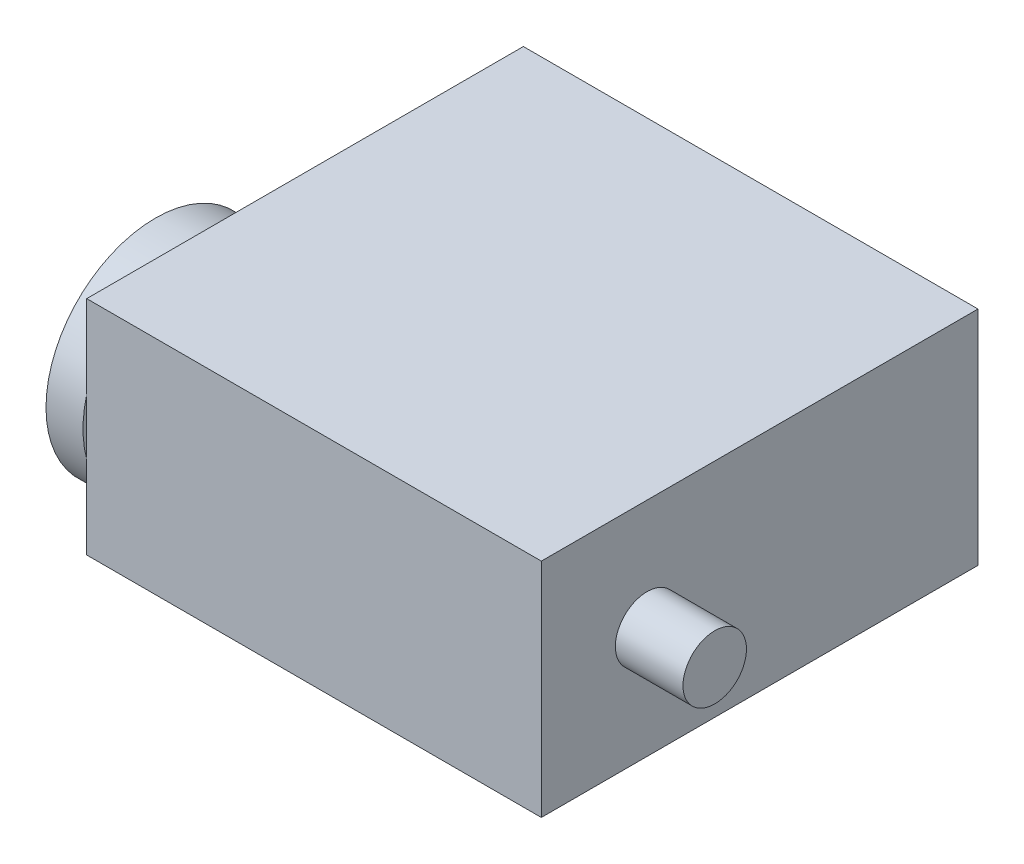
ISO-10303-21;
HEADER;
FILE_DESCRIPTION(('STEP AP214'),'2;1');
FILE_NAME('part.step','',(''),(''),'','','');
FILE_SCHEMA(('AUTOMOTIVE_DESIGN { 1 0 10303 214 1 1 1 1 }'));
ENDSEC;
DATA;
#1=APPLICATION_CONTEXT('core data for automotive mechanical design processes');
#2=APPLICATION_PROTOCOL_DEFINITION('international standard','automotive_design',2000,#1);
#3=PRODUCT_CONTEXT('',#1,'mechanical');
#4=PRODUCT('Part','Part','',(#3));
#5=PRODUCT_RELATED_PRODUCT_CATEGORY('part','',(#4));
#6=PRODUCT_DEFINITION_FORMATION('','',#4);
#7=PRODUCT_DEFINITION_CONTEXT('part definition',#1,'design');
#8=PRODUCT_DEFINITION('design','',#6,#7);
#9=PRODUCT_DEFINITION_SHAPE('','',#8);
#10=(LENGTH_UNIT() NAMED_UNIT(*) SI_UNIT(.MILLI.,.METRE.));
#11=(NAMED_UNIT(*) PLANE_ANGLE_UNIT() SI_UNIT($,.RADIAN.));
#12=(NAMED_UNIT(*) SI_UNIT($,.STERADIAN.) SOLID_ANGLE_UNIT());
#13=UNCERTAINTY_MEASURE_WITH_UNIT(LENGTH_MEASURE(1.E-05),#10,'distance_accuracy_value','');
#14=(GEOMETRIC_REPRESENTATION_CONTEXT(3) GLOBAL_UNCERTAINTY_ASSIGNED_CONTEXT((#13)) GLOBAL_UNIT_ASSIGNED_CONTEXT((#10,
#11,#12)) REPRESENTATION_CONTEXT('',''));
#15=CARTESIAN_POINT('',(0.,0.,0.));
#16=DIRECTION('',(0.,0.,1.));
#17=DIRECTION('',(1.,0.,0.));
#18=AXIS2_PLACEMENT_3D('',#15,#16,#17);
#19=CARTESIAN_POINT('',(-25.,10.5,41.3));
#20=DIRECTION('',(-1.,0.,0.));
#21=DIRECTION('',(0.,-1.,0.));
#22=AXIS2_PLACEMENT_3D('',#19,#20,#21);
#23=PLANE('',#22);
#24=CARTESIAN_POINT('',(-25.,7.45,31.3000000000001));
#25=DIRECTION('',(-1.,0.,0.));
#26=DIRECTION('',(0.,-1.,0.));
#27=AXIS2_PLACEMENT_3D('',#24,#25,#26);
#28=CIRCLE('',#27,0.749999999999996);
#29=CARTESIAN_POINT('',(-25.,6.70000000000001,31.3000000000001));
#30=VERTEX_POINT('',#29);
#31=EDGE_CURVE('E346',#30,#30,#28,.T.);
#32=ORIENTED_EDGE('',*,*,#31,.F.);
#33=EDGE_LOOP('',(#32));
#34=FACE_BOUND('',#33,.T.);
#35=CARTESIAN_POINT('',(-25.,0.,23.85));
#36=DIRECTION('',(-1.,0.,0.));
#37=DIRECTION('',(0.,-1.,0.));
#38=AXIS2_PLACEMENT_3D('',#35,#36,#37);
#39=CIRCLE('',#38,0.749999999999997);
#40=CARTESIAN_POINT('',(-25.,-0.749999999999936,23.85));
#41=VERTEX_POINT('',#40);
#42=EDGE_CURVE('E345',#41,#41,#39,.T.);
#43=ORIENTED_EDGE('',*,*,#42,.F.);
#44=EDGE_LOOP('',(#43));
#45=FACE_BOUND('',#44,.T.);
#46=CARTESIAN_POINT('',(-25.,-7.44999999999999,31.3));
#47=DIRECTION('',(-1.,0.,0.));
#48=DIRECTION('',(0.,-1.,0.));
#49=AXIS2_PLACEMENT_3D('',#46,#47,#48);
#50=CIRCLE('',#49,0.749999999999997);
#51=CARTESIAN_POINT('',(-25.,-8.19999999999999,31.3));
#52=VERTEX_POINT('',#51);
#53=EDGE_CURVE('E355',#52,#52,#50,.T.);
#54=ORIENTED_EDGE('',*,*,#53,.F.);
#55=EDGE_LOOP('',(#54));
#56=FACE_BOUND('',#55,.T.);
#57=CARTESIAN_POINT('',(-25.,0.,38.75));
#58=DIRECTION('',(-1.,0.,0.));
#59=DIRECTION('',(0.,-1.,0.));
#60=AXIS2_PLACEMENT_3D('',#57,#58,#59);
#61=CIRCLE('',#60,0.749999999999999);
#62=CARTESIAN_POINT('',(-25.,-0.749999999999993,38.75));
#63=VERTEX_POINT('',#62);
#64=EDGE_CURVE('E360',#63,#63,#61,.T.);
#65=ORIENTED_EDGE('',*,*,#64,.F.);
#66=EDGE_LOOP('',(#65));
#67=FACE_BOUND('',#66,.T.);
#68=CARTESIAN_POINT('',(-25.,0.,31.3));
#69=DIRECTION('',(-1.,0.,0.));
#70=DIRECTION('',(0.,-1.,0.));
#71=AXIS2_PLACEMENT_3D('',#68,#69,#70);
#72=CIRCLE('',#71,10.35);
#73=CARTESIAN_POINT('',(-25.,-10.35,31.3));
#74=VERTEX_POINT('',#73);
#75=EDGE_CURVE('E108',#74,#74,#72,.T.);
#76=ORIENTED_EDGE('',*,*,#75,.T.);
#77=EDGE_LOOP('',(#76));
#78=FACE_BOUND('',#77,.T.);
#79=CARTESIAN_POINT('',(-25.,0.,31.3));
#80=DIRECTION('',(-1.,0.,0.));
#81=DIRECTION('',(0.,-1.,0.));
#82=AXIS2_PLACEMENT_3D('',#79,#80,#81);
#83=CIRCLE('',#82,6.);
#84=CARTESIAN_POINT('',(-25.,-6.,31.3));
#85=VERTEX_POINT('',#84);
#86=EDGE_CURVE('E113',#85,#85,#83,.T.);
#87=ORIENTED_EDGE('',*,*,#86,.F.);
#88=EDGE_LOOP('',(#87));
#89=FACE_BOUND('',#88,.T.);
#90=ADVANCED_FACE('F37',(#34,#45,#56,#67,#78,#89),#23,.T.);
#91=CARTESIAN_POINT('',(-21.5,10.5,41.3));
#92=DIRECTION('',(1.,0.,0.));
#93=DIRECTION('',(0.,0.,-1.));
#94=AXIS2_PLACEMENT_3D('',#91,#92,#93);
#95=PLANE('',#94);
#96=CARTESIAN_POINT('',(-21.5,0.,31.3));
#97=DIRECTION('',(-1.,0.,0.));
#98=DIRECTION('',(0.,0.,1.));
#99=AXIS2_PLACEMENT_3D('',#96,#97,#98);
#100=CIRCLE('',#99,10.35);
#101=CARTESIAN_POINT('',(-21.5,2.66880122901651,41.3));
#102=VERTEX_POINT('',#101);
#103=CARTESIAN_POINT('',(-21.5,-2.66880122901649,41.3));
#104=VERTEX_POINT('',#103);
#105=EDGE_CURVE('E52',#102,#104,#100,.T.);
#106=ORIENTED_EDGE('',*,*,#105,.F.);
#107=DIRECTION('',(0.,-1.,0.));
#108=VECTOR('',#107,1.);
#109=CARTESIAN_POINT('',(-21.5,10.5,41.3));
#110=LINE('',#109,#108);
#111=CARTESIAN_POINT('',(-21.5,10.5,41.3));
#112=VERTEX_POINT('',#111);
#113=EDGE_CURVE('E93',#112,#102,#110,.T.);
#114=ORIENTED_EDGE('',*,*,#113,.F.);
#115=DIRECTION('',(0.,0.,-1.));
#116=VECTOR('',#115,1.);
#117=CARTESIAN_POINT('',(-21.5,10.5,41.3));
#118=LINE('',#117,#116);
#119=CARTESIAN_POINT('',(-21.5,10.5,0.));
#120=VERTEX_POINT('',#119);
#121=EDGE_CURVE('E124',#112,#120,#118,.T.);
#122=ORIENTED_EDGE('',*,*,#121,.T.);
#123=DIRECTION('',(0.,-1.,0.));
#124=VECTOR('',#123,1.);
#125=CARTESIAN_POINT('',(-21.5,10.5,0.));
#126=LINE('',#125,#124);
#127=CARTESIAN_POINT('',(-21.5,-10.5,0.));
#128=VERTEX_POINT('',#127);
#129=EDGE_CURVE('E117',#120,#128,#126,.T.);
#130=ORIENTED_EDGE('',*,*,#129,.T.);
#131=DIRECTION('',(0.,0.,-1.));
#132=VECTOR('',#131,1.);
#133=CARTESIAN_POINT('',(-21.5,-10.5,41.3));
#134=LINE('',#133,#132);
#135=CARTESIAN_POINT('',(-21.5,-10.5,41.3));
#136=VERTEX_POINT('',#135);
#137=EDGE_CURVE('E45',#136,#128,#134,.T.);
#138=ORIENTED_EDGE('',*,*,#137,.F.);
#139=EDGE_CURVE('E87',#104,#136,#110,.T.);
#140=ORIENTED_EDGE('',*,*,#139,.F.);
#141=EDGE_LOOP('',(#106,#114,#122,#130,#138,#140));
#142=FACE_BOUND('',#141,.T.);
#143=ADVANCED_FACE('F39',(#142),#95,.F.);
#144=CARTESIAN_POINT('',(21.5,10.5,41.3));
#145=DIRECTION('',(-1.,0.,0.));
#146=DIRECTION('',(0.,-1.,0.));
#147=AXIS2_PLACEMENT_3D('',#144,#145,#146);
#148=PLANE('',#147);
#149=DIRECTION('',(0.,1.,0.));
#150=VECTOR('',#149,1.);
#151=CARTESIAN_POINT('',(21.5,10.5,0.));
#152=LINE('',#151,#150);
#153=CARTESIAN_POINT('',(21.5,-10.5,0.));
#154=VERTEX_POINT('',#153);
#155=CARTESIAN_POINT('',(21.5,10.5,0.));
#156=VERTEX_POINT('',#155);
#157=EDGE_CURVE('E128',#154,#156,#152,.T.);
#158=ORIENTED_EDGE('',*,*,#157,.T.);
#159=DIRECTION('',(0.,0.,-1.));
#160=VECTOR('',#159,1.);
#161=CARTESIAN_POINT('',(21.5,10.5,41.3));
#162=LINE('',#161,#160);
#163=CARTESIAN_POINT('',(21.5,10.5,41.3));
#164=VERTEX_POINT('',#163);
#165=EDGE_CURVE('E132',#164,#156,#162,.T.);
#166=ORIENTED_EDGE('',*,*,#165,.F.);
#167=DIRECTION('',(0.,1.,0.));
#168=VECTOR('',#167,1.);
#169=CARTESIAN_POINT('',(21.5,10.5,41.3));
#170=LINE('',#169,#168);
#171=CARTESIAN_POINT('',(21.5,-10.5,41.3));
#172=VERTEX_POINT('',#171);
#173=EDGE_CURVE('E121',#172,#164,#170,.T.);
#174=ORIENTED_EDGE('',*,*,#173,.F.);
#175=DIRECTION('',(0.,0.,-1.));
#176=VECTOR('',#175,1.);
#177=CARTESIAN_POINT('',(21.5,-10.5,41.3));
#178=LINE('',#177,#176);
#179=EDGE_CURVE('E134',#172,#154,#178,.T.);
#180=ORIENTED_EDGE('',*,*,#179,.T.);
#181=EDGE_LOOP('',(#158,#166,#174,#180));
#182=FACE_BOUND('',#181,.T.);
#183=CARTESIAN_POINT('',(21.5,0.,31.3));
#184=DIRECTION('',(-1.,0.,0.));
#185=DIRECTION('',(0.,-1.,0.));
#186=AXIS2_PLACEMENT_3D('',#183,#184,#185);
#187=CIRCLE('',#186,3.);
#188=CARTESIAN_POINT('',(21.5,-2.99999999999999,31.3));
#189=VERTEX_POINT('',#188);
#190=EDGE_CURVE('E12',#189,#189,#187,.F.);
#191=ORIENTED_EDGE('',*,*,#190,.F.);
#192=EDGE_LOOP('',(#191));
#193=FACE_BOUND('',#192,.T.);
#194=ADVANCED_FACE('F145',(#182,#193),#148,.F.);
#195=CARTESIAN_POINT('',(21.5,-10.5,41.3));
#196=DIRECTION('',(0.,1.,0.));
#197=DIRECTION('',(-1.,0.,0.));
#198=AXIS2_PLACEMENT_3D('',#195,#196,#197);
#199=PLANE('',#198);
#200=DIRECTION('',(1.,0.,0.));
#201=VECTOR('',#200,1.);
#202=CARTESIAN_POINT('',(21.5,-10.5,0.));
#203=LINE('',#202,#201);
#204=EDGE_CURVE('E126',#128,#154,#203,.T.);
#205=ORIENTED_EDGE('',*,*,#204,.T.);
#206=ORIENTED_EDGE('',*,*,#179,.F.);
#207=DIRECTION('',(1.,0.,0.));
#208=VECTOR('',#207,1.);
#209=CARTESIAN_POINT('',(21.5,-10.5,41.3));
#210=LINE('',#209,#208);
#211=EDGE_CURVE('E119',#136,#172,#210,.T.);
#212=ORIENTED_EDGE('',*,*,#211,.F.);
#213=ORIENTED_EDGE('',*,*,#137,.T.);
#214=EDGE_LOOP('',(#205,#206,#212,#213));
#215=FACE_BOUND('',#214,.T.);
#216=ADVANCED_FACE('F137',(#215),#199,.F.);
#217=CARTESIAN_POINT('',(21.5,10.5,41.3));
#218=DIRECTION('',(0.,-1.,0.));
#219=DIRECTION('',(1.,0.,0.));
#220=AXIS2_PLACEMENT_3D('',#217,#218,#219);
#221=PLANE('',#220);
#222=DIRECTION('',(-1.,0.,0.));
#223=VECTOR('',#222,1.);
#224=CARTESIAN_POINT('',(21.5,10.5,0.));
#225=LINE('',#224,#223);
#226=EDGE_CURVE('E81',#156,#120,#225,.T.);
#227=ORIENTED_EDGE('',*,*,#226,.T.);
#228=ORIENTED_EDGE('',*,*,#121,.F.);
#229=DIRECTION('',(-1.,0.,0.));
#230=VECTOR('',#229,1.);
#231=CARTESIAN_POINT('',(21.5,10.5,41.3));
#232=LINE('',#231,#230);
#233=EDGE_CURVE('E60',#164,#112,#232,.T.);
#234=ORIENTED_EDGE('',*,*,#233,.F.);
#235=ORIENTED_EDGE('',*,*,#165,.T.);
#236=EDGE_LOOP('',(#227,#228,#234,#235));
#237=FACE_BOUND('',#236,.T.);
#238=ADVANCED_FACE('F148',(#237),#221,.F.);
#239=CARTESIAN_POINT('',(0.,0.,41.3));
#240=DIRECTION('',(0.,0.,-1.));
#241=DIRECTION('',(-1.,0.,0.));
#242=AXIS2_PLACEMENT_3D('',#239,#240,#241);
#243=PLANE('',#242);
#244=ORIENTED_EDGE('',*,*,#113,.T.);
#245=EDGE_CURVE('E91',#102,#104,#110,.T.);
#246=ORIENTED_EDGE('',*,*,#245,.T.);
#247=ORIENTED_EDGE('',*,*,#139,.T.);
#248=ORIENTED_EDGE('',*,*,#211,.T.);
#249=ORIENTED_EDGE('',*,*,#173,.T.);
#250=ORIENTED_EDGE('',*,*,#233,.T.);
#251=EDGE_LOOP('',(#244,#246,#247,#248,#249,#250));
#252=FACE_BOUND('',#251,.T.);
#253=ADVANCED_FACE('F92',(#252),#243,.F.);
#254=CARTESIAN_POINT('',(0.,0.,0.));
#255=DIRECTION('',(0.,0.,-1.));
#256=DIRECTION('',(-1.,0.,0.));
#257=AXIS2_PLACEMENT_3D('',#254,#255,#256);
#258=PLANE('',#257);
#259=ORIENTED_EDGE('',*,*,#129,.F.);
#260=ORIENTED_EDGE('',*,*,#226,.F.);
#261=ORIENTED_EDGE('',*,*,#157,.F.);
#262=ORIENTED_EDGE('',*,*,#204,.F.);
#263=EDGE_LOOP('',(#259,#260,#261,#262));
#264=FACE_BOUND('',#263,.T.);
#265=ADVANCED_FACE('F141',(#264),#258,.T.);
#266=CARTESIAN_POINT('',(27.9,0.,31.3));
#267=DIRECTION('',(-1.,0.,0.));
#268=DIRECTION('',(0.,-1.,0.));
#269=AXIS2_PLACEMENT_3D('',#266,#267,#268);
#270=CYLINDRICAL_SURFACE('',#269,3.);
#271=CARTESIAN_POINT('',(27.9,0.,31.3));
#272=DIRECTION('',(1.,0.,0.));
#273=DIRECTION('',(0.,1.,0.));
#274=AXIS2_PLACEMENT_3D('',#271,#272,#273);
#275=CIRCLE('',#274,3.);
#276=CARTESIAN_POINT('',(27.9,3.00000000000001,31.3));
#277=VERTEX_POINT('',#276);
#278=EDGE_CURVE('E110',#277,#277,#275,.T.);
#279=ORIENTED_EDGE('',*,*,#278,.F.);
#280=EDGE_LOOP('',(#279));
#281=FACE_BOUND('',#280,.T.);
#282=ORIENTED_EDGE('',*,*,#190,.T.);
#283=EDGE_LOOP('',(#282));
#284=FACE_BOUND('',#283,.T.);
#285=ADVANCED_FACE('F174',(#281,#284),#270,.T.);
#286=CARTESIAN_POINT('',(27.9,0.,31.3));
#287=DIRECTION('',(1.,0.,0.));
#288=DIRECTION('',(0.,1.,0.));
#289=AXIS2_PLACEMENT_3D('',#286,#287,#288);
#290=PLANE('',#289);
#291=ORIENTED_EDGE('',*,*,#278,.T.);
#292=EDGE_LOOP('',(#291));
#293=FACE_BOUND('',#292,.T.);
#294=ADVANCED_FACE('F171',(#293),#290,.T.);
#295=CARTESIAN_POINT('',(-100.774220741123,0.,31.3));
#296=DIRECTION('',(1.,0.,0.));
#297=DIRECTION('',(0.,0.,-1.));
#298=AXIS2_PLACEMENT_3D('',#295,#296,#297);
#299=CYLINDRICAL_SURFACE('',#298,10.35);
#300=ORIENTED_EDGE('',*,*,#105,.T.);
#301=EDGE_CURVE('E101',#104,#102,#100,.T.);
#302=ORIENTED_EDGE('',*,*,#301,.T.);
#303=EDGE_LOOP('',(#300,#302));
#304=FACE_BOUND('',#303,.T.);
#305=ORIENTED_EDGE('',*,*,#75,.F.);
#306=EDGE_LOOP('',(#305));
#307=FACE_BOUND('',#306,.T.);
#308=ADVANCED_FACE('F106',(#304,#307),#299,.T.);
#309=CARTESIAN_POINT('',(-21.5,0.,31.3));
#310=DIRECTION('',(-1.,0.,0.));
#311=DIRECTION('',(0.,0.,1.));
#312=AXIS2_PLACEMENT_3D('',#309,#310,#311);
#313=PLANE('',#312);
#314=ORIENTED_EDGE('',*,*,#245,.F.);
#315=ORIENTED_EDGE('',*,*,#301,.F.);
#316=EDGE_LOOP('',(#314,#315));
#317=FACE_BOUND('',#316,.T.);
#318=ADVANCED_FACE('F102',(#317),#313,.F.);
#319=CARTESIAN_POINT('',(-26.5,0.,31.3));
#320=DIRECTION('',(1.,0.,0.));
#321=DIRECTION('',(0.,1.,0.));
#322=AXIS2_PLACEMENT_3D('',#319,#320,#321);
#323=CYLINDRICAL_SURFACE('',#322,6.);
#324=CARTESIAN_POINT('',(-26.5,0.,31.3));
#325=DIRECTION('',(-1.,0.,0.));
#326=DIRECTION('',(0.,-1.,0.));
#327=AXIS2_PLACEMENT_3D('',#324,#325,#326);
#328=CIRCLE('',#327,6.);
#329=CARTESIAN_POINT('',(-26.5,-6.,31.3));
#330=VERTEX_POINT('',#329);
#331=EDGE_CURVE('E104',#330,#330,#328,.T.);
#332=ORIENTED_EDGE('',*,*,#331,.F.);
#333=EDGE_LOOP('',(#332));
#334=FACE_BOUND('',#333,.T.);
#335=ORIENTED_EDGE('',*,*,#86,.T.);
#336=EDGE_LOOP('',(#335));
#337=FACE_BOUND('',#336,.T.);
#338=ADVANCED_FACE('F204',(#334,#337),#323,.T.);
#339=CARTESIAN_POINT('',(-26.5,0.,31.3));
#340=DIRECTION('',(-1.,0.,0.));
#341=DIRECTION('',(0.,-1.,0.));
#342=AXIS2_PLACEMENT_3D('',#339,#340,#341);
#343=PLANE('',#342);
#344=ORIENTED_EDGE('',*,*,#331,.T.);
#345=EDGE_LOOP('',(#344));
#346=FACE_BOUND('',#345,.T.);
#347=ADVANCED_FACE('F210',(#346),#343,.T.);
#348=CARTESIAN_POINT('',(-21.,0.,38.75));
#349=DIRECTION('',(-1.,0.,0.));
#350=DIRECTION('',(0.,-1.,0.));
#351=AXIS2_PLACEMENT_3D('',#348,#349,#350);
#352=CYLINDRICAL_SURFACE('',#351,0.749999999999999);
#353=CARTESIAN_POINT('',(-21.,0.,38.75));
#354=DIRECTION('',(-1.,0.,0.));
#355=DIRECTION('',(0.,-1.,0.));
#356=AXIS2_PLACEMENT_3D('',#353,#354,#355);
#357=CIRCLE('',#356,0.749999999999999);
#358=CARTESIAN_POINT('',(-21.,-0.749999999999991,38.75));
#359=VERTEX_POINT('',#358);
#360=EDGE_CURVE('E363',#359,#359,#357,.T.);
#361=ORIENTED_EDGE('',*,*,#360,.F.);
#362=EDGE_LOOP('',(#361));
#363=FACE_BOUND('',#362,.T.);
#364=ORIENTED_EDGE('',*,*,#64,.T.);
#365=EDGE_LOOP('',(#364));
#366=FACE_BOUND('',#365,.T.);
#367=ADVANCED_FACE('F217',(#363,#366),#352,.F.);
#368=CARTESIAN_POINT('',(-21.,0.,38.75));
#369=DIRECTION('',(-1.,0.,0.));
#370=DIRECTION('',(0.,-1.,0.));
#371=AXIS2_PLACEMENT_3D('',#368,#369,#370);
#372=PLANE('',#371);
#373=ORIENTED_EDGE('',*,*,#360,.T.);
#374=EDGE_LOOP('',(#373));
#375=FACE_BOUND('',#374,.T.);
#376=ADVANCED_FACE('F224',(#375),#372,.T.);
#377=CARTESIAN_POINT('',(-21.,-7.44999999999999,31.3));
#378=DIRECTION('',(-1.,0.,0.));
#379=DIRECTION('',(0.,-1.,0.));
#380=AXIS2_PLACEMENT_3D('',#377,#378,#379);
#381=CYLINDRICAL_SURFACE('',#380,0.749999999999997);
#382=CARTESIAN_POINT('',(-21.,-7.44999999999999,31.3));
#383=DIRECTION('',(-1.,0.,0.));
#384=DIRECTION('',(0.,-1.,0.));
#385=AXIS2_PLACEMENT_3D('',#382,#383,#384);
#386=CIRCLE('',#385,0.749999999999997);
#387=CARTESIAN_POINT('',(-21.,-8.19999999999999,31.3));
#388=VERTEX_POINT('',#387);
#389=EDGE_CURVE('E357',#388,#388,#386,.T.);
#390=ORIENTED_EDGE('',*,*,#389,.F.);
#391=EDGE_LOOP('',(#390));
#392=FACE_BOUND('',#391,.T.);
#393=ORIENTED_EDGE('',*,*,#53,.T.);
#394=EDGE_LOOP('',(#393));
#395=FACE_BOUND('',#394,.T.);
#396=ADVANCED_FACE('F232',(#392,#395),#381,.F.);
#397=CARTESIAN_POINT('',(-21.,-7.44999999999999,31.3));
#398=DIRECTION('',(-1.,0.,0.));
#399=DIRECTION('',(0.,-1.,0.));
#400=AXIS2_PLACEMENT_3D('',#397,#398,#399);
#401=PLANE('',#400);
#402=ORIENTED_EDGE('',*,*,#389,.T.);
#403=EDGE_LOOP('',(#402));
#404=FACE_BOUND('',#403,.T.);
#405=ADVANCED_FACE('F240',(#404),#401,.T.);
#406=CARTESIAN_POINT('',(-21.,0.,23.85));
#407=DIRECTION('',(-1.,0.,0.));
#408=DIRECTION('',(0.,-1.,0.));
#409=AXIS2_PLACEMENT_3D('',#406,#407,#408);
#410=CYLINDRICAL_SURFACE('',#409,0.749999999999997);
#411=CARTESIAN_POINT('',(-21.,0.,23.85));
#412=DIRECTION('',(-1.,0.,0.));
#413=DIRECTION('',(0.,-1.,0.));
#414=AXIS2_PLACEMENT_3D('',#411,#412,#413);
#415=CIRCLE('',#414,0.749999999999997);
#416=CARTESIAN_POINT('',(-21.,-0.749999999999935,23.85));
#417=VERTEX_POINT('',#416);
#418=EDGE_CURVE('E349',#417,#417,#415,.T.);
#419=ORIENTED_EDGE('',*,*,#418,.F.);
#420=EDGE_LOOP('',(#419));
#421=FACE_BOUND('',#420,.T.);
#422=ORIENTED_EDGE('',*,*,#42,.T.);
#423=EDGE_LOOP('',(#422));
#424=FACE_BOUND('',#423,.T.);
#425=ADVANCED_FACE('F248',(#421,#424),#410,.F.);
#426=CARTESIAN_POINT('',(-21.,0.,23.85));
#427=DIRECTION('',(-1.,0.,0.));
#428=DIRECTION('',(0.,-1.,0.));
#429=AXIS2_PLACEMENT_3D('',#426,#427,#428);
#430=PLANE('',#429);
#431=ORIENTED_EDGE('',*,*,#418,.T.);
#432=EDGE_LOOP('',(#431));
#433=FACE_BOUND('',#432,.T.);
#434=ADVANCED_FACE('F256',(#433),#430,.T.);
#435=CARTESIAN_POINT('',(-21.,7.45000000000001,31.3000000000001));
#436=DIRECTION('',(-1.,0.,0.));
#437=DIRECTION('',(0.,-1.,0.));
#438=AXIS2_PLACEMENT_3D('',#435,#436,#437);
#439=CYLINDRICAL_SURFACE('',#438,0.749999999999996);
#440=CARTESIAN_POINT('',(-21.,7.45000000000001,31.3000000000001));
#441=DIRECTION('',(-1.,0.,0.));
#442=DIRECTION('',(0.,-1.,0.));
#443=AXIS2_PLACEMENT_3D('',#440,#441,#442);
#444=CIRCLE('',#443,0.749999999999996);
#445=CARTESIAN_POINT('',(-21.,6.70000000000001,31.3000000000001));
#446=VERTEX_POINT('',#445);
#447=EDGE_CURVE('E344',#446,#446,#444,.T.);
#448=ORIENTED_EDGE('',*,*,#447,.F.);
#449=EDGE_LOOP('',(#448));
#450=FACE_BOUND('',#449,.T.);
#451=ORIENTED_EDGE('',*,*,#31,.T.);
#452=EDGE_LOOP('',(#451));
#453=FACE_BOUND('',#452,.T.);
#454=ADVANCED_FACE('F264',(#450,#453),#439,.F.);
#455=CARTESIAN_POINT('',(-21.,7.45000000000001,31.3000000000001));
#456=DIRECTION('',(-1.,0.,0.));
#457=DIRECTION('',(0.,-1.,0.));
#458=AXIS2_PLACEMENT_3D('',#455,#456,#457);
#459=PLANE('',#458);
#460=ORIENTED_EDGE('',*,*,#447,.T.);
#461=EDGE_LOOP('',(#460));
#462=FACE_BOUND('',#461,.T.);
#463=ADVANCED_FACE('F272',(#462),#459,.T.);
#464=CLOSED_SHELL('',(#90,#143,#194,#216,#238,#253,#265,#285,#294,#308,#318,#338,#347,#367,#376,
#396,#405,#425,#434,#454,#463));
#465=MANIFOLD_SOLID_BREP('B2',#464);
#466=ADVANCED_BREP_SHAPE_REPRESENTATION('',(#18,#465),#14);
#467=SHAPE_DEFINITION_REPRESENTATION(#9,#466);
ENDSEC;
END-ISO-10303-21;
